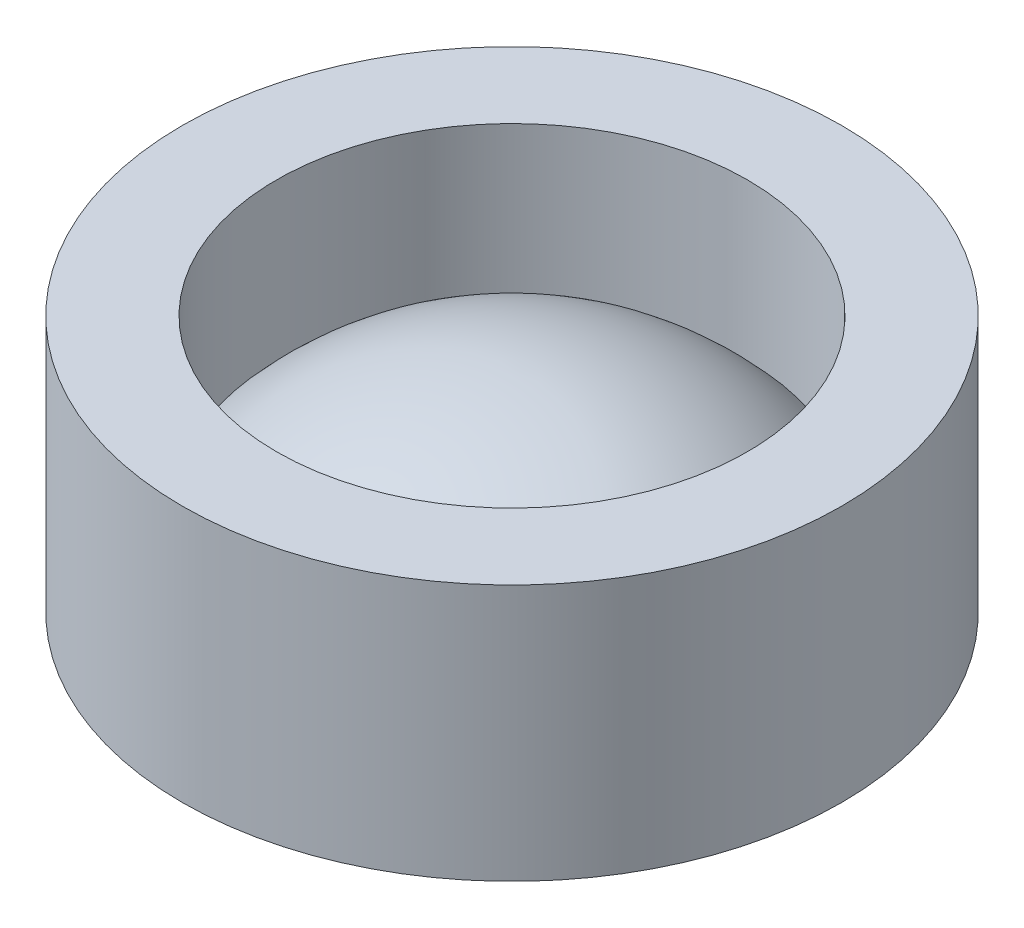
ISO-10303-21;
HEADER;
FILE_DESCRIPTION(('STEP AP214'),'2;1');
FILE_NAME('part.step','',(''),(''),'','','');
FILE_SCHEMA(('AUTOMOTIVE_DESIGN { 1 0 10303 214 1 1 1 1 }'));
ENDSEC;
DATA;
#1=APPLICATION_CONTEXT('core data for automotive mechanical design processes');
#2=APPLICATION_PROTOCOL_DEFINITION('international standard','automotive_design',2000,#1);
#3=PRODUCT_CONTEXT('',#1,'mechanical');
#4=PRODUCT('Part','Part','',(#3));
#5=PRODUCT_RELATED_PRODUCT_CATEGORY('part','',(#4));
#6=PRODUCT_DEFINITION_FORMATION('','',#4);
#7=PRODUCT_DEFINITION_CONTEXT('part definition',#1,'design');
#8=PRODUCT_DEFINITION('design','',#6,#7);
#9=PRODUCT_DEFINITION_SHAPE('','',#8);
#10=(LENGTH_UNIT() NAMED_UNIT(*) SI_UNIT(.MILLI.,.METRE.));
#11=(NAMED_UNIT(*) PLANE_ANGLE_UNIT() SI_UNIT($,.RADIAN.));
#12=(NAMED_UNIT(*) SI_UNIT($,.STERADIAN.) SOLID_ANGLE_UNIT());
#13=UNCERTAINTY_MEASURE_WITH_UNIT(LENGTH_MEASURE(1.E-05),#10,'distance_accuracy_value','');
#14=(GEOMETRIC_REPRESENTATION_CONTEXT(3) GLOBAL_UNCERTAINTY_ASSIGNED_CONTEXT((#13)) GLOBAL_UNIT_ASSIGNED_CONTEXT((#10,
#11,#12)) REPRESENTATION_CONTEXT('',''));
#15=CARTESIAN_POINT('',(0.,0.,0.));
#16=DIRECTION('',(0.,0.,1.));
#17=DIRECTION('',(1.,0.,0.));
#18=AXIS2_PLACEMENT_3D('',#15,#16,#17);
#19=CARTESIAN_POINT('',(0.,8.174080160432,0.));
#20=DIRECTION('',(0.,-1.,0.));
#21=DIRECTION('',(0.,0.,-1.));
#22=AXIS2_PLACEMENT_3D('',#19,#20,#21);
#23=CYLINDRICAL_SURFACE('',#22,10.5);
#24=CARTESIAN_POINT('',(0.,8.174080160432,0.));
#25=DIRECTION('',(0.,1.,0.));
#26=DIRECTION('',(0.,0.,1.));
#27=AXIS2_PLACEMENT_3D('',#24,#25,#26);
#28=CIRCLE('',#27,10.5);
#29=CARTESIAN_POINT('',(0.,8.174080160432,10.5));
#30=VERTEX_POINT('',#29);
#31=EDGE_CURVE('E10',#30,#30,#28,.T.);
#32=ORIENTED_EDGE('',*,*,#31,.F.);
#33=EDGE_LOOP('',(#32));
#34=FACE_BOUND('',#33,.T.);
#35=CARTESIAN_POINT('',(0.,0.,0.));
#36=DIRECTION('',(0.,1.,0.));
#37=DIRECTION('',(0.,0.,1.));
#38=AXIS2_PLACEMENT_3D('',#35,#36,#37);
#39=CIRCLE('',#38,10.5);
#40=CARTESIAN_POINT('',(0.,0.,10.5));
#41=VERTEX_POINT('',#40);
#42=EDGE_CURVE('E37',#41,#41,#39,.T.);
#43=ORIENTED_EDGE('',*,*,#42,.T.);
#44=EDGE_LOOP('',(#43));
#45=FACE_BOUND('',#44,.T.);
#46=ADVANCED_FACE('F34',(#34,#45),#23,.T.);
#47=CARTESIAN_POINT('',(0.,8.174080160432,0.));
#48=DIRECTION('',(0.,1.,0.));
#49=DIRECTION('',(0.,0.,1.));
#50=AXIS2_PLACEMENT_3D('',#47,#48,#49);
#51=PLANE('',#50);
#52=CARTESIAN_POINT('',(0.,8.174080160432,0.));
#53=DIRECTION('',(0.,-1.,0.));
#54=DIRECTION('',(0.,0.,-1.));
#55=AXIS2_PLACEMENT_3D('',#52,#53,#54);
#56=CIRCLE('',#55,7.5);
#57=CARTESIAN_POINT('',(0.,8.174080160432,-7.5));
#58=VERTEX_POINT('',#57);
#59=EDGE_CURVE('E48',#58,#58,#56,.T.);
#60=ORIENTED_EDGE('',*,*,#59,.T.);
#61=EDGE_LOOP('',(#60));
#62=FACE_BOUND('',#61,.T.);
#63=ORIENTED_EDGE('',*,*,#31,.T.);
#64=EDGE_LOOP('',(#63));
#65=FACE_BOUND('',#64,.T.);
#66=ADVANCED_FACE('F52',(#62,#65),#51,.T.);
#67=CARTESIAN_POINT('',(0.,0.,0.));
#68=DIRECTION('',(0.,1.,0.));
#69=DIRECTION('',(0.,0.,1.));
#70=AXIS2_PLACEMENT_3D('',#67,#68,#69);
#71=PLANE('',#70);
#72=ORIENTED_EDGE('',*,*,#42,.F.);
#73=EDGE_LOOP('',(#72));
#74=FACE_BOUND('',#73,.T.);
#75=ADVANCED_FACE('F62',(#74),#71,.F.);
#76=CARTESIAN_POINT('',(0.,-3.44029811722948,0.));
#77=DIRECTION('',(0.,-1.,0.));
#78=DIRECTION('',(0.,0.,1.));
#79=AXIS2_PLACEMENT_3D('',#76,#77,#78);
#80=SPHERICAL_SURFACE('',#79,10.);
#81=CARTESIAN_POINT('',(0.,3.174080160432,0.));
#82=DIRECTION('',(0.,-1.,0.));
#83=DIRECTION('',(0.,0.,-1.));
#84=AXIS2_PLACEMENT_3D('',#81,#82,#83);
#85=CIRCLE('',#84,7.5);
#86=CARTESIAN_POINT('',(0.,3.174080160432,-7.5));
#87=VERTEX_POINT('',#86);
#88=EDGE_CURVE('E44',#87,#87,#85,.T.);
#89=ORIENTED_EDGE('',*,*,#88,.F.);
#90=EDGE_LOOP('',(#89));
#91=FACE_BOUND('',#90,.T.);
#92=ADVANCED_FACE('F57',(#91),#80,.T.);
#93=CARTESIAN_POINT('',(0.,0.0490987680048355,0.));
#94=DIRECTION('',(0.,-1.,0.));
#95=DIRECTION('',(0.,0.,-1.));
#96=AXIS2_PLACEMENT_3D('',#93,#94,#95);
#97=CYLINDRICAL_SURFACE('',#96,7.5);
#98=ORIENTED_EDGE('',*,*,#59,.F.);
#99=EDGE_LOOP('',(#98));
#100=FACE_BOUND('',#99,.T.);
#101=ORIENTED_EDGE('',*,*,#88,.T.);
#102=EDGE_LOOP('',(#101));
#103=FACE_BOUND('',#102,.T.);
#104=ADVANCED_FACE('F54',(#100,#103),#97,.F.);
#105=CLOSED_SHELL('',(#46,#66,#75,#92,#104));
#106=MANIFOLD_SOLID_BREP('B2',#105);
#107=ADVANCED_BREP_SHAPE_REPRESENTATION('',(#18,#106),#14);
#108=SHAPE_DEFINITION_REPRESENTATION(#9,#107);
ENDSEC;
END-ISO-10303-21;
